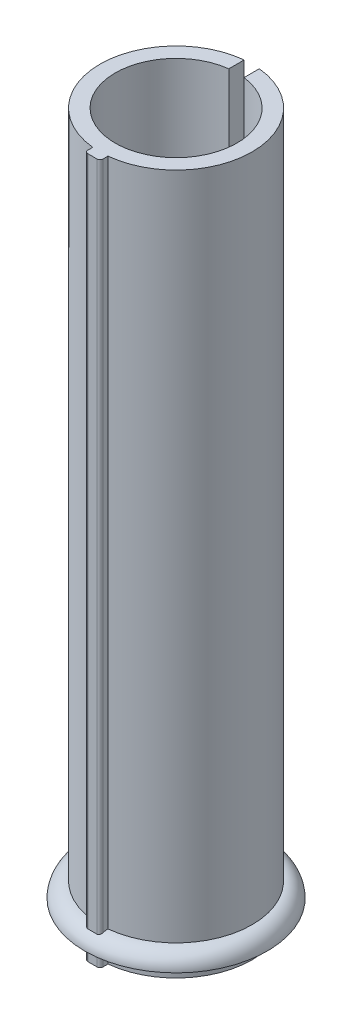
ISO-10303-21;
HEADER;
FILE_DESCRIPTION(('STEP AP214'),'2;1');
FILE_NAME('part.step','',(''),(''),'','','');
FILE_SCHEMA(('AUTOMOTIVE_DESIGN { 1 0 10303 214 1 1 1 1 }'));
ENDSEC;
DATA;
#1=APPLICATION_CONTEXT('core data for automotive mechanical design processes');
#2=APPLICATION_PROTOCOL_DEFINITION('international standard','automotive_design',2000,#1);
#3=PRODUCT_CONTEXT('',#1,'mechanical');
#4=PRODUCT('Part','Part','',(#3));
#5=PRODUCT_RELATED_PRODUCT_CATEGORY('part','',(#4));
#6=PRODUCT_DEFINITION_FORMATION('','',#4);
#7=PRODUCT_DEFINITION_CONTEXT('part definition',#1,'design');
#8=PRODUCT_DEFINITION('design','',#6,#7);
#9=PRODUCT_DEFINITION_SHAPE('','',#8);
#10=(LENGTH_UNIT() NAMED_UNIT(*) SI_UNIT(.MILLI.,.METRE.));
#11=(NAMED_UNIT(*) PLANE_ANGLE_UNIT() SI_UNIT($,.RADIAN.));
#12=(NAMED_UNIT(*) SI_UNIT($,.STERADIAN.) SOLID_ANGLE_UNIT());
#13=UNCERTAINTY_MEASURE_WITH_UNIT(LENGTH_MEASURE(1.E-05),#10,'distance_accuracy_value','');
#14=(GEOMETRIC_REPRESENTATION_CONTEXT(3) GLOBAL_UNCERTAINTY_ASSIGNED_CONTEXT((#13)) GLOBAL_UNIT_ASSIGNED_CONTEXT((#10,
#11,#12)) REPRESENTATION_CONTEXT('',''));
#15=CARTESIAN_POINT('',(0.,0.,0.));
#16=DIRECTION('',(0.,0.,1.));
#17=DIRECTION('',(1.,0.,0.));
#18=AXIS2_PLACEMENT_3D('',#15,#16,#17);
#19=CARTESIAN_POINT('',(0.,-5.,0.));
#20=DIRECTION('',(0.,1.,0.));
#21=DIRECTION('',(0.,0.,1.));
#22=AXIS2_PLACEMENT_3D('',#19,#20,#21);
#23=CYLINDRICAL_SURFACE('',#22,25.);
#24=DIRECTION('',(0.,1.,0.));
#25=VECTOR('',#24,1.);
#26=CARTESIAN_POINT('',(2.5,-5.,-24.8746859276655));
#27=LINE('',#26,#25);
#28=CARTESIAN_POINT('',(2.5,-5.,-24.8746859276655));
#29=VERTEX_POINT('',#28);
#30=CARTESIAN_POINT('',(2.5,0.,-24.8746859276655));
#31=VERTEX_POINT('',#30);
#32=EDGE_CURVE('E194',#29,#31,#27,.T.);
#33=ORIENTED_EDGE('',*,*,#32,.T.);
#34=CARTESIAN_POINT('',(0.,0.,0.));
#35=DIRECTION('',(0.,1.,0.));
#36=DIRECTION('',(0.,0.,1.));
#37=AXIS2_PLACEMENT_3D('',#34,#35,#36);
#38=CIRCLE('',#37,25.);
#39=CARTESIAN_POINT('',(2.5,0.,24.8746859276655));
#40=VERTEX_POINT('',#39);
#41=EDGE_CURVE('E217',#31,#40,#38,.F.);
#42=ORIENTED_EDGE('',*,*,#41,.T.);
#43=DIRECTION('',(0.,1.,0.));
#44=VECTOR('',#43,1.);
#45=CARTESIAN_POINT('',(2.5,-5.,24.8746859276655));
#46=LINE('',#45,#44);
#47=CARTESIAN_POINT('',(2.5,-5.,24.8746859276655));
#48=VERTEX_POINT('',#47);
#49=EDGE_CURVE('E332',#48,#40,#46,.T.);
#50=ORIENTED_EDGE('',*,*,#49,.F.);
#51=CARTESIAN_POINT('',(0.,-5.,0.));
#52=DIRECTION('',(0.,1.,0.));
#53=DIRECTION('',(0.,0.,1.));
#54=AXIS2_PLACEMENT_3D('',#51,#52,#53);
#55=CIRCLE('',#54,25.);
#56=EDGE_CURVE('E292',#48,#29,#55,.T.);
#57=ORIENTED_EDGE('',*,*,#56,.T.);
#58=EDGE_LOOP('',(#33,#42,#50,#57));
#59=FACE_BOUND('',#58,.T.);
#60=ADVANCED_FACE('F39',(#59),#23,.T.);
#61=CARTESIAN_POINT('',(2.5,-5.,24.8746859276655));
#62=DIRECTION('',(1.,0.,0.));
#63=DIRECTION('',(0.,0.,-1.));
#64=AXIS2_PLACEMENT_3D('',#61,#62,#63);
#65=PLANE('',#64);
#66=ORIENTED_EDGE('',*,*,#49,.T.);
#67=DIRECTION('',(0.,0.,1.));
#68=VECTOR('',#67,1.);
#69=CARTESIAN_POINT('',(2.5,0.,24.8746859276655));
#70=LINE('',#69,#68);
#71=CARTESIAN_POINT('',(2.5,0.,26.5));
#72=VERTEX_POINT('',#71);
#73=EDGE_CURVE('E224',#40,#72,#70,.T.);
#74=ORIENTED_EDGE('',*,*,#73,.T.);
#75=DIRECTION('',(0.,1.,0.));
#76=VECTOR('',#75,1.);
#77=CARTESIAN_POINT('',(2.5,-5.,26.5));
#78=LINE('',#77,#76);
#79=CARTESIAN_POINT('',(2.5,-5.,26.5));
#80=VERTEX_POINT('',#79);
#81=EDGE_CURVE('E337',#80,#72,#78,.T.);
#82=ORIENTED_EDGE('',*,*,#81,.F.);
#83=DIRECTION('',(0.,0.,-1.));
#84=VECTOR('',#83,1.);
#85=CARTESIAN_POINT('',(2.5,-5.,24.8746859276655));
#86=LINE('',#85,#84);
#87=EDGE_CURVE('E328',#80,#48,#86,.T.);
#88=ORIENTED_EDGE('',*,*,#87,.T.);
#89=EDGE_LOOP('',(#66,#74,#82,#88));
#90=FACE_BOUND('',#89,.T.);
#91=ADVANCED_FACE('F428',(#90),#65,.T.);
#92=CARTESIAN_POINT('',(1.5,-5.,26.5));
#93=DIRECTION('',(0.,1.,0.));
#94=DIRECTION('',(0.,0.,1.));
#95=AXIS2_PLACEMENT_3D('',#92,#93,#94);
#96=CYLINDRICAL_SURFACE('',#95,1.);
#97=ORIENTED_EDGE('',*,*,#81,.T.);
#98=CARTESIAN_POINT('',(1.5,0.,26.5));
#99=DIRECTION('',(0.,1.,0.));
#100=DIRECTION('',(0.,0.,1.));
#101=AXIS2_PLACEMENT_3D('',#98,#99,#100);
#102=CIRCLE('',#101,1.);
#103=CARTESIAN_POINT('',(1.5,0.,27.5));
#104=VERTEX_POINT('',#103);
#105=EDGE_CURVE('E227',#72,#104,#102,.F.);
#106=ORIENTED_EDGE('',*,*,#105,.T.);
#107=DIRECTION('',(0.,1.,0.));
#108=VECTOR('',#107,1.);
#109=CARTESIAN_POINT('',(1.5,-5.,27.5));
#110=LINE('',#109,#108);
#111=CARTESIAN_POINT('',(1.5,-5.,27.5));
#112=VERTEX_POINT('',#111);
#113=EDGE_CURVE('E341',#112,#104,#110,.T.);
#114=ORIENTED_EDGE('',*,*,#113,.F.);
#115=CARTESIAN_POINT('',(1.5,-5.,26.5));
#116=DIRECTION('',(0.,1.,0.));
#117=DIRECTION('',(0.,0.,1.));
#118=AXIS2_PLACEMENT_3D('',#115,#116,#117);
#119=CIRCLE('',#118,1.);
#120=EDGE_CURVE('E324',#112,#80,#119,.T.);
#121=ORIENTED_EDGE('',*,*,#120,.T.);
#122=EDGE_LOOP('',(#97,#106,#114,#121));
#123=FACE_BOUND('',#122,.T.);
#124=ADVANCED_FACE('F436',(#123),#96,.T.);
#125=CARTESIAN_POINT('',(-1.49999999999999,-5.,27.5));
#126=DIRECTION('',(0.,0.,1.));
#127=DIRECTION('',(1.,0.,0.));
#128=AXIS2_PLACEMENT_3D('',#125,#126,#127);
#129=PLANE('',#128);
#130=ORIENTED_EDGE('',*,*,#113,.T.);
#131=DIRECTION('',(-1.,0.,0.));
#132=VECTOR('',#131,1.);
#133=CARTESIAN_POINT('',(-1.49999999999999,0.,27.5));
#134=LINE('',#133,#132);
#135=CARTESIAN_POINT('',(-1.5,0.,27.5));
#136=VERTEX_POINT('',#135);
#137=EDGE_CURVE('E230',#104,#136,#134,.T.);
#138=ORIENTED_EDGE('',*,*,#137,.T.);
#139=DIRECTION('',(0.,1.,0.));
#140=VECTOR('',#139,1.);
#141=CARTESIAN_POINT('',(-1.5,-5.,27.5));
#142=LINE('',#141,#140);
#143=CARTESIAN_POINT('',(-1.5,-5.,27.5));
#144=VERTEX_POINT('',#143);
#145=EDGE_CURVE('E345',#144,#136,#142,.T.);
#146=ORIENTED_EDGE('',*,*,#145,.F.);
#147=DIRECTION('',(1.,0.,0.));
#148=VECTOR('',#147,1.);
#149=CARTESIAN_POINT('',(-1.49999999999999,-5.,27.5));
#150=LINE('',#149,#148);
#151=EDGE_CURVE('E320',#144,#112,#150,.T.);
#152=ORIENTED_EDGE('',*,*,#151,.T.);
#153=EDGE_LOOP('',(#130,#138,#146,#152));
#154=FACE_BOUND('',#153,.T.);
#155=ADVANCED_FACE('F469',(#154),#129,.T.);
#156=CARTESIAN_POINT('',(-1.5,-5.,26.5));
#157=DIRECTION('',(0.,1.,0.));
#158=DIRECTION('',(0.,0.,1.));
#159=AXIS2_PLACEMENT_3D('',#156,#157,#158);
#160=CYLINDRICAL_SURFACE('',#159,1.);
#161=ORIENTED_EDGE('',*,*,#145,.T.);
#162=CARTESIAN_POINT('',(-1.5,0.,26.5));
#163=DIRECTION('',(0.,1.,0.));
#164=DIRECTION('',(0.,0.,1.));
#165=AXIS2_PLACEMENT_3D('',#162,#163,#164);
#166=CIRCLE('',#165,1.);
#167=CARTESIAN_POINT('',(-2.5,0.,26.5));
#168=VERTEX_POINT('',#167);
#169=EDGE_CURVE('E233',#136,#168,#166,.F.);
#170=ORIENTED_EDGE('',*,*,#169,.T.);
#171=DIRECTION('',(0.,1.,0.));
#172=VECTOR('',#171,1.);
#173=CARTESIAN_POINT('',(-2.5,-5.,26.5));
#174=LINE('',#173,#172);
#175=CARTESIAN_POINT('',(-2.5,-5.,26.5));
#176=VERTEX_POINT('',#175);
#177=EDGE_CURVE('E350',#176,#168,#174,.T.);
#178=ORIENTED_EDGE('',*,*,#177,.F.);
#179=CARTESIAN_POINT('',(-1.5,-5.,26.5));
#180=DIRECTION('',(0.,1.,0.));
#181=DIRECTION('',(0.,0.,1.));
#182=AXIS2_PLACEMENT_3D('',#179,#180,#181);
#183=CIRCLE('',#182,1.);
#184=EDGE_CURVE('E316',#176,#144,#183,.T.);
#185=ORIENTED_EDGE('',*,*,#184,.T.);
#186=EDGE_LOOP('',(#161,#170,#178,#185));
#187=FACE_BOUND('',#186,.T.);
#188=ADVANCED_FACE('F467',(#187),#160,.T.);
#189=CARTESIAN_POINT('',(-2.5,-5.,24.8746859276655));
#190=DIRECTION('',(-1.,0.,0.));
#191=DIRECTION('',(0.,0.,1.));
#192=AXIS2_PLACEMENT_3D('',#189,#190,#191);
#193=PLANE('',#192);
#194=ORIENTED_EDGE('',*,*,#177,.T.);
#195=DIRECTION('',(0.,0.,-1.));
#196=VECTOR('',#195,1.);
#197=CARTESIAN_POINT('',(-2.5,0.,24.8746859276655));
#198=LINE('',#197,#196);
#199=CARTESIAN_POINT('',(-2.5,0.,24.8746859276655));
#200=VERTEX_POINT('',#199);
#201=EDGE_CURVE('E236',#168,#200,#198,.T.);
#202=ORIENTED_EDGE('',*,*,#201,.T.);
#203=DIRECTION('',(0.,1.,0.));
#204=VECTOR('',#203,1.);
#205=CARTESIAN_POINT('',(-2.5,-5.,24.8746859276655));
#206=LINE('',#205,#204);
#207=CARTESIAN_POINT('',(-2.5,-5.,24.8746859276655));
#208=VERTEX_POINT('',#207);
#209=EDGE_CURVE('E355',#208,#200,#206,.T.);
#210=ORIENTED_EDGE('',*,*,#209,.F.);
#211=DIRECTION('',(0.,0.,1.));
#212=VECTOR('',#211,1.);
#213=CARTESIAN_POINT('',(-2.5,-5.,24.8746859276655));
#214=LINE('',#213,#212);
#215=EDGE_CURVE('E312',#208,#176,#214,.T.);
#216=ORIENTED_EDGE('',*,*,#215,.T.);
#217=EDGE_LOOP('',(#194,#202,#210,#216));
#218=FACE_BOUND('',#217,.T.);
#219=ADVANCED_FACE('F401',(#218),#193,.T.);
#220=CARTESIAN_POINT('',(0.,-5.,0.));
#221=DIRECTION('',(0.,1.,0.));
#222=DIRECTION('',(0.,0.,1.));
#223=AXIS2_PLACEMENT_3D('',#220,#221,#222);
#224=CYLINDRICAL_SURFACE('',#223,25.);
#225=ORIENTED_EDGE('',*,*,#209,.T.);
#226=CARTESIAN_POINT('',(0.,0.,0.));
#227=DIRECTION('',(0.,1.,0.));
#228=DIRECTION('',(0.,0.,1.));
#229=AXIS2_PLACEMENT_3D('',#226,#227,#228);
#230=CIRCLE('',#229,25.);
#231=CARTESIAN_POINT('',(-2.5,0.,-24.8746859276655));
#232=VERTEX_POINT('',#231);
#233=EDGE_CURVE('E239',#200,#232,#230,.F.);
#234=ORIENTED_EDGE('',*,*,#233,.T.);
#235=DIRECTION('',(0.,1.,0.));
#236=VECTOR('',#235,1.);
#237=CARTESIAN_POINT('',(-2.5,-5.,-24.8746859276655));
#238=LINE('',#237,#236);
#239=CARTESIAN_POINT('',(-2.5,-5.,-24.8746859276655));
#240=VERTEX_POINT('',#239);
#241=EDGE_CURVE('E360',#240,#232,#238,.T.);
#242=ORIENTED_EDGE('',*,*,#241,.F.);
#243=CARTESIAN_POINT('',(0.,-5.,0.));
#244=DIRECTION('',(0.,1.,0.));
#245=DIRECTION('',(0.,0.,1.));
#246=AXIS2_PLACEMENT_3D('',#243,#244,#245);
#247=CIRCLE('',#246,25.);
#248=EDGE_CURVE('E308',#240,#208,#247,.T.);
#249=ORIENTED_EDGE('',*,*,#248,.T.);
#250=EDGE_LOOP('',(#225,#234,#242,#249));
#251=FACE_BOUND('',#250,.T.);
#252=ADVANCED_FACE('F408',(#251),#224,.T.);
#253=CARTESIAN_POINT('',(-2.5,-5.,-19.8431348329844));
#254=DIRECTION('',(1.,0.,0.));
#255=DIRECTION('',(0.,0.,-1.));
#256=AXIS2_PLACEMENT_3D('',#253,#254,#255);
#257=PLANE('',#256);
#258=ORIENTED_EDGE('',*,*,#241,.T.);
#259=DIRECTION('',(0.,0.,1.));
#260=VECTOR('',#259,1.);
#261=CARTESIAN_POINT('',(-2.5,0.,-19.8431348329844));
#262=LINE('',#261,#260);
#263=CARTESIAN_POINT('',(-2.5,0.,-19.8431348329844));
#264=VERTEX_POINT('',#263);
#265=EDGE_CURVE('E242',#232,#264,#262,.T.);
#266=ORIENTED_EDGE('',*,*,#265,.T.);
#267=DIRECTION('',(0.,1.,0.));
#268=VECTOR('',#267,1.);
#269=CARTESIAN_POINT('',(-2.5,-5.,-19.8431348329844));
#270=LINE('',#269,#268);
#271=CARTESIAN_POINT('',(-2.5,-5.,-19.8431348329844));
#272=VERTEX_POINT('',#271);
#273=EDGE_CURVE('E365',#272,#264,#270,.T.);
#274=ORIENTED_EDGE('',*,*,#273,.F.);
#275=DIRECTION('',(0.,0.,-1.));
#276=VECTOR('',#275,1.);
#277=CARTESIAN_POINT('',(-2.5,-5.,-19.8431348329844));
#278=LINE('',#277,#276);
#279=EDGE_CURVE('E304',#272,#240,#278,.T.);
#280=ORIENTED_EDGE('',*,*,#279,.T.);
#281=EDGE_LOOP('',(#258,#266,#274,#280));
#282=FACE_BOUND('',#281,.T.);
#283=ADVANCED_FACE('F412',(#282),#257,.T.);
#284=CARTESIAN_POINT('',(2.5,-5.,-19.8431348329844));
#285=DIRECTION('',(-1.,0.,0.));
#286=DIRECTION('',(0.,0.,1.));
#287=AXIS2_PLACEMENT_3D('',#284,#285,#286);
#288=PLANE('',#287);
#289=DIRECTION('',(0.,1.,0.));
#290=VECTOR('',#289,1.);
#291=CARTESIAN_POINT('',(2.5,-5.,-19.8431348329844));
#292=LINE('',#291,#290);
#293=CARTESIAN_POINT('',(2.5,-5.,-19.8431348329844));
#294=VERTEX_POINT('',#293);
#295=CARTESIAN_POINT('',(2.5,0.,-19.8431348329844));
#296=VERTEX_POINT('',#295);
#297=EDGE_CURVE('E193',#294,#296,#292,.T.);
#298=ORIENTED_EDGE('',*,*,#297,.T.);
#299=DIRECTION('',(0.,0.,-1.));
#300=VECTOR('',#299,1.);
#301=CARTESIAN_POINT('',(2.5,0.,-19.8431348329844));
#302=LINE('',#301,#300);
#303=EDGE_CURVE('E204',#296,#31,#302,.T.);
#304=ORIENTED_EDGE('',*,*,#303,.T.);
#305=ORIENTED_EDGE('',*,*,#32,.F.);
#306=DIRECTION('',(0.,0.,1.));
#307=VECTOR('',#306,1.);
#308=CARTESIAN_POINT('',(2.5,-5.,-19.8431348329844));
#309=LINE('',#308,#307);
#310=EDGE_CURVE('E296',#29,#294,#309,.T.);
#311=ORIENTED_EDGE('',*,*,#310,.T.);
#312=EDGE_LOOP('',(#298,#304,#305,#311));
#313=FACE_BOUND('',#312,.T.);
#314=ADVANCED_FACE('F418',(#313),#288,.T.);
#315=CARTESIAN_POINT('',(0.,5.,0.));
#316=DIRECTION('',(0.,1.,0.));
#317=DIRECTION('',(0.,0.,1.));
#318=AXIS2_PLACEMENT_3D('',#315,#316,#317);
#319=CIRCLE('',#318,25.);
#320=CARTESIAN_POINT('',(2.5,5.,-24.8746859276655));
#321=VERTEX_POINT('',#320);
#322=CARTESIAN_POINT('',(2.5,5.,24.8746859276655));
#323=VERTEX_POINT('',#322);
#324=EDGE_CURVE('E245',#321,#323,#319,.F.);
#325=ORIENTED_EDGE('',*,*,#324,.F.);
#326=CARTESIAN_POINT('',(2.5,225.,-24.8746859276655));
#327=VERTEX_POINT('',#326);
#328=EDGE_CURVE('E200',#321,#327,#27,.T.);
#329=ORIENTED_EDGE('',*,*,#328,.T.);
#330=CARTESIAN_POINT('',(0.,225.,0.));
#331=DIRECTION('',(0.,1.,0.));
#332=DIRECTION('',(0.,0.,1.));
#333=AXIS2_PLACEMENT_3D('',#330,#331,#332);
#334=CIRCLE('',#333,25.);
#335=CARTESIAN_POINT('',(2.5,225.,24.8746859276655));
#336=VERTEX_POINT('',#335);
#337=EDGE_CURVE('E255',#336,#327,#334,.T.);
#338=ORIENTED_EDGE('',*,*,#337,.F.);
#339=EDGE_CURVE('E336',#323,#336,#46,.T.);
#340=ORIENTED_EDGE('',*,*,#339,.F.);
#341=EDGE_LOOP('',(#325,#329,#338,#340));
#342=FACE_BOUND('',#341,.T.);
#343=ADVANCED_FACE('F419',(#342),#23,.T.);
#344=CARTESIAN_POINT('',(2.5,4.73108501515423,26.5));
#345=VERTEX_POINT('',#344);
#346=CARTESIAN_POINT('',(2.5,225.,26.5));
#347=VERTEX_POINT('',#346);
#348=EDGE_CURVE('E60',#345,#347,#78,.T.);
#349=ORIENTED_EDGE('',*,*,#348,.F.);
#350=CARTESIAN_POINT('',(2.5,4.73108501515423,26.5));
#351=CARTESIAN_POINT('',(2.5,4.77568571154399,26.3690188122208));
#352=CARTESIAN_POINT('',(2.5,4.81486236841745,26.2361943761114));
#353=CARTESIAN_POINT('',(2.5,4.88194298696545,25.9686718117443));
#354=CARTESIAN_POINT('',(2.5,4.90992049404703,25.8339921239666));
#355=CARTESIAN_POINT('',(2.5,4.95477867167907,25.5627985303928));
#356=CARTESIAN_POINT('',(2.5,4.97165941315023,25.4262846363251));
#357=CARTESIAN_POINT('',(2.5,4.99431401461683,25.151413770997));
#358=CARTESIAN_POINT('',(2.5,5.00001242725479,25.0130505789747));
#359=CARTESIAN_POINT('',(2.5,5.,24.8746859276655));
#360=B_SPLINE_CURVE_WITH_KNOTS('',3,(#350,#351,#352,#353,#354,#355,#356,#357,#358,#359),
.UNSPECIFIED.,.F.,.F.,(4,2,2,2,4),(0.,0.414976925700271,0.827182115937586,1.23938467169812,
1.6543589309556),.UNSPECIFIED.);
#361=EDGE_CURVE('E11',#345,#323,#360,.T.);
#362=ORIENTED_EDGE('',*,*,#361,.T.);
#363=ORIENTED_EDGE('',*,*,#339,.T.);
#364=DIRECTION('',(0.,0.,-1.));
#365=VECTOR('',#364,1.);
#366=CARTESIAN_POINT('',(2.5,225.,24.8746859276655));
#367=LINE('',#366,#365);
#368=EDGE_CURVE('E288',#347,#336,#367,.T.);
#369=ORIENTED_EDGE('',*,*,#368,.F.);
#370=EDGE_LOOP('',(#349,#362,#363,#369));
#371=FACE_BOUND('',#370,.T.);
#372=ADVANCED_FACE('F421',(#371),#65,.T.);
#373=CARTESIAN_POINT('',(1.5,4.3062669903341,27.5));
#374=VERTEX_POINT('',#373);
#375=CARTESIAN_POINT('',(1.5,225.,27.5));
#376=VERTEX_POINT('',#375);
#377=EDGE_CURVE('E67',#374,#376,#110,.T.);
#378=ORIENTED_EDGE('',*,*,#377,.F.);
#379=CARTESIAN_POINT('',(1.5,4.3062669903341,27.5));
#380=CARTESIAN_POINT('',(1.52542514005268,4.30544779825903,27.5000015178773));
#381=CARTESIAN_POINT('',(1.55085554431769,4.30518292201786,27.4990295796368));
#382=CARTESIAN_POINT('',(1.60154856244067,4.30575435231049,27.4951552132795));
#383=CARTESIAN_POINT('',(1.6268112258746,4.30659031746843,27.4922533837687));
#384=CARTESIAN_POINT('',(1.70183532556383,4.31072326394032,27.4807180782456));
#385=CARTESIAN_POINT('',(1.75110861252743,4.31563675258997,27.4692543468811));
#386=CARTESIAN_POINT('',(1.84679286094547,4.32938677301816,27.4392827422562));
#387=CARTESIAN_POINT('',(1.89320596871457,4.33822032128135,27.420780227664));
#388=CARTESIAN_POINT('',(1.98220852104497,4.35917988941921,27.3774548719788));
#389=CARTESIAN_POINT('',(2.02479449200809,4.3713088609241,27.3526263660965));
#390=CARTESIAN_POINT('',(2.10744121902948,4.39882665013424,27.2960242803881));
#391=CARTESIAN_POINT('',(2.14725238886705,4.41435307556053,27.2639547442836));
#392=CARTESIAN_POINT('',(2.22113412084935,4.4473873829196,27.1946467648329));
#393=CARTESIAN_POINT('',(2.25520211759608,4.46489614452878,27.1574060250536));
#394=CARTESIAN_POINT('',(2.3208801384558,4.50329132402285,27.0738538727171));
#395=CARTESIAN_POINT('',(2.35169957241962,4.52433053930137,27.0269901913995));
#396=CARTESIAN_POINT('',(2.40503927200349,4.56691889028568,26.9289745748721));
#397=CARTESIAN_POINT('',(2.42755841526003,4.58846809453313,26.8778220608744));
#398=CARTESIAN_POINT('',(2.46352159744723,4.63086014156109,26.7731904730696));
#399=CARTESIAN_POINT('',(2.47710564381874,4.65170877057509,26.7197619902835));
#400=CARTESIAN_POINT('',(2.49535299467913,4.6923593383146,26.6110051857504));
#401=CARTESIAN_POINT('',(2.50001366777915,4.71216096661961,26.5556763084962));
#402=CARTESIAN_POINT('',(2.5,4.73108501515419,26.5));
#403=B_SPLINE_CURVE_WITH_KNOTS('',3,(#379,#380,#381,#382,#383,#384,#385,#386,#387,#388,#389,
#390,#391,#392,#393,#394,#395,#396,#397,#398,#399,#400,#401,#402),.UNSPECIFIED.,.F.,.F.,(4,2,2,
2,2,2,2,2,2,2,2,4),(0.,0.0762656217552419,0.152507598766534,0.304175316353956,0.455727798713986,
0.607416472987797,0.76706088385312,0.926776417849669,1.10573361050072,1.28471499283489,
1.46082044507498,1.63697782057126),.UNSPECIFIED.);
#404=EDGE_CURVE('E54',#374,#345,#403,.T.);
#405=ORIENTED_EDGE('',*,*,#404,.T.);
#406=ORIENTED_EDGE('',*,*,#348,.T.);
#407=CARTESIAN_POINT('',(1.5,225.,26.5));
#408=DIRECTION('',(0.,1.,0.));
#409=DIRECTION('',(0.,0.,1.));
#410=AXIS2_PLACEMENT_3D('',#407,#408,#409);
#411=CIRCLE('',#410,1.);
#412=EDGE_CURVE('E284',#376,#347,#411,.T.);
#413=ORIENTED_EDGE('',*,*,#412,.F.);
#414=EDGE_LOOP('',(#378,#405,#406,#413));
#415=FACE_BOUND('',#414,.T.);
#416=ADVANCED_FACE('F427',(#415),#96,.T.);
#417=CARTESIAN_POINT('',(-1.5,4.3062669903341,27.5));
#418=VERTEX_POINT('',#417);
#419=CARTESIAN_POINT('',(-1.5,225.,27.5));
#420=VERTEX_POINT('',#419);
#421=EDGE_CURVE('E349',#418,#420,#142,.T.);
#422=ORIENTED_EDGE('',*,*,#421,.F.);
#423=CARTESIAN_POINT('',(-1.5,4.3062669903341,27.5));
#424=CARTESIAN_POINT('',(-1.25005334932238,4.31427968215083,27.5));
#425=CARTESIAN_POINT('',(-1.00004296433229,4.32024518484277,27.5));
#426=CARTESIAN_POINT('',(-0.500021708817723,4.32816834659106,27.5));
#427=CARTESIAN_POINT('',(-0.250010854408862,4.33012701893014,27.5));
#428=CARTESIAN_POINT('',(0.250010854408862,4.33012701893014,27.5));
#429=CARTESIAN_POINT('',(0.500021708817723,4.32816834659106,27.5));
#430=CARTESIAN_POINT('',(1.00004296433229,4.32024518484277,27.5));
#431=CARTESIAN_POINT('',(1.25005334932238,4.31427968215083,27.5));
#432=CARTESIAN_POINT('',(1.5,4.3062669903341,27.5));
#433=B_SPLINE_CURVE_WITH_KNOTS('',3,(#423,#424,#425,#426,#427,#428,#429,#430,#431,#432),
.UNSPECIFIED.,.F.,.F.,(4,2,2,2,4),(0.,0.750213822316163,1.50023790045688,2.2502619785976,
3.00047580091376),.UNSPECIFIED.);
#434=EDGE_CURVE('E488',#418,#374,#433,.T.);
#435=ORIENTED_EDGE('',*,*,#434,.T.);
#436=ORIENTED_EDGE('',*,*,#377,.T.);
#437=DIRECTION('',(1.,0.,0.));
#438=VECTOR('',#437,1.);
#439=CARTESIAN_POINT('',(-1.49999999999999,225.,27.5));
#440=LINE('',#439,#438);
#441=EDGE_CURVE('E280',#420,#376,#440,.T.);
#442=ORIENTED_EDGE('',*,*,#441,.F.);
#443=EDGE_LOOP('',(#422,#435,#436,#442));
#444=FACE_BOUND('',#443,.T.);
#445=ADVANCED_FACE('F471',(#444),#129,.T.);
#446=CARTESIAN_POINT('',(-2.5,4.73108501515423,26.5));
#447=VERTEX_POINT('',#446);
#448=CARTESIAN_POINT('',(-2.5,225.,26.5));
#449=VERTEX_POINT('',#448);
#450=EDGE_CURVE('E354',#447,#449,#174,.T.);
#451=ORIENTED_EDGE('',*,*,#450,.F.);
#452=CARTESIAN_POINT('',(-2.5,4.73108501515423,26.5));
#453=CARTESIAN_POINT('',(-2.50001739949812,4.71058879509126,26.5603247984808));
#454=CARTESIAN_POINT('',(-2.49454520881726,4.68905522001453,26.6202323170742));
#455=CARTESIAN_POINT('',(-2.47317024852415,4.64483666543262,26.7376725550921));
#456=CARTESIAN_POINT('',(-2.45727531604888,4.62215256285491,26.7952070243529));
#457=CARTESIAN_POINT('',(-2.41561260669543,4.57653450298506,26.9064273708881));
#458=CARTESIAN_POINT('',(-2.38984992094265,4.55360068045066,26.9601152158455));
#459=CARTESIAN_POINT('',(-2.32902704968068,4.50854354779879,27.0623631269312));
#460=CARTESIAN_POINT('',(-2.29396342382236,4.48642054104957,27.1109212863146));
#461=CARTESIAN_POINT('',(-2.21494359753246,4.44409436109972,27.2017857409825));
#462=CARTESIAN_POINT('',(-2.17093441367647,4.42390373331824,27.2440520579236));
#463=CARTESIAN_POINT('',(-2.07502725283776,4.38702883452189,27.3204221458031));
#464=CARTESIAN_POINT('',(-2.0231334538411,4.37034271758875,27.3545302152269));
#465=CARTESIAN_POINT('',(-1.91751674326718,4.34317605948388,27.4104640061131));
#466=CARTESIAN_POINT('',(-1.86432096045477,4.332289641705,27.4330852942744));
#467=CARTESIAN_POINT('',(-1.75412519397334,4.31575318122285,27.4688937902549));
#468=CARTESIAN_POINT('',(-1.69713459261454,4.31009070312766,27.4821033850822));
#469=CARTESIAN_POINT('',(-1.61629973941916,4.30622549286048,27.4934901634356));
#470=CARTESIAN_POINT('',(-1.59309568655235,4.30558519106267,27.4959310735868));
#471=CARTESIAN_POINT('',(-1.54659407288781,4.30523206035956,27.4991846563097));
#472=CARTESIAN_POINT('',(-1.52329665416467,4.30551814151529,27.4999992405168));
#473=CARTESIAN_POINT('',(-1.5,4.3062669903341,27.5));
#474=B_SPLINE_CURVE_WITH_KNOTS('',3,(#452,#453,#454,#455,#456,#457,#458,#459,#460,#461,#462,
#463,#464,#465,#466,#467,#468,#469,#470,#471,#472,#473),.UNSPECIFIED.,.F.,.F.,(4,2,2,2,2,2,2,2,
2,2,4),(0.,0.19080738669647,0.381471464508688,0.572037304149357,0.762673731220781,
0.954474018767247,1.1461730252662,1.3216367118425,1.49668162775865,1.56664303992081,
1.63652216867035),.UNSPECIFIED.);
#475=EDGE_CURVE('E387',#447,#418,#474,.T.);
#476=ORIENTED_EDGE('',*,*,#475,.T.);
#477=ORIENTED_EDGE('',*,*,#421,.T.);
#478=CARTESIAN_POINT('',(-1.5,225.,26.5));
#479=DIRECTION('',(0.,1.,0.));
#480=DIRECTION('',(0.,0.,1.));
#481=AXIS2_PLACEMENT_3D('',#478,#479,#480);
#482=CIRCLE('',#481,1.);
#483=EDGE_CURVE('E276',#449,#420,#482,.T.);
#484=ORIENTED_EDGE('',*,*,#483,.F.);
#485=EDGE_LOOP('',(#451,#476,#477,#484));
#486=FACE_BOUND('',#485,.T.);
#487=ADVANCED_FACE('F399',(#486),#160,.T.);
#488=CARTESIAN_POINT('',(-2.5,5.,24.8746859276655));
#489=VERTEX_POINT('',#488);
#490=CARTESIAN_POINT('',(-2.5,225.,24.8746859276655));
#491=VERTEX_POINT('',#490);
#492=EDGE_CURVE('E359',#489,#491,#206,.T.);
#493=ORIENTED_EDGE('',*,*,#492,.F.);
#494=CARTESIAN_POINT('',(-2.5,5.,24.8746859276655));
#495=CARTESIAN_POINT('',(-2.5,5.00001242725479,25.0130505789747));
#496=CARTESIAN_POINT('',(-2.5,4.99431401461683,25.151413770997));
#497=CARTESIAN_POINT('',(-2.5,4.97165941315023,25.4262846363252));
#498=CARTESIAN_POINT('',(-2.5,4.95477867167907,25.5627985303928));
#499=CARTESIAN_POINT('',(-2.5,4.90992049404703,25.8339921239666));
#500=CARTESIAN_POINT('',(-2.5,4.88194298696546,25.9686718117443));
#501=CARTESIAN_POINT('',(-2.5,4.81486236841744,26.2361943761114));
#502=CARTESIAN_POINT('',(-2.5,4.77568571154397,26.3690188122209));
#503=CARTESIAN_POINT('',(-2.5,4.73108501515419,26.5));
#504=B_SPLINE_CURVE_WITH_KNOTS('',3,(#494,#495,#496,#497,#498,#499,#500,#501,#502,#503),
.UNSPECIFIED.,.F.,.F.,(4,2,2,2,4),(0.,0.414974259257486,0.82717681501802,1.23938200525534,
1.65435893095562),.UNSPECIFIED.);
#505=EDGE_CURVE('E378',#489,#447,#504,.T.);
#506=ORIENTED_EDGE('',*,*,#505,.T.);
#507=ORIENTED_EDGE('',*,*,#450,.T.);
#508=DIRECTION('',(0.,0.,1.));
#509=VECTOR('',#508,1.);
#510=CARTESIAN_POINT('',(-2.5,225.,24.8746859276655));
#511=LINE('',#510,#509);
#512=EDGE_CURVE('E272',#491,#449,#511,.T.);
#513=ORIENTED_EDGE('',*,*,#512,.F.);
#514=EDGE_LOOP('',(#493,#506,#507,#513));
#515=FACE_BOUND('',#514,.T.);
#516=ADVANCED_FACE('F394',(#515),#193,.T.);
#517=CARTESIAN_POINT('',(0.,5.,0.));
#518=DIRECTION('',(0.,1.,0.));
#519=DIRECTION('',(0.,0.,1.));
#520=AXIS2_PLACEMENT_3D('',#517,#518,#519);
#521=CIRCLE('',#520,25.);
#522=CARTESIAN_POINT('',(-2.5,5.,-24.8746859276655));
#523=VERTEX_POINT('',#522);
#524=EDGE_CURVE('E249',#489,#523,#521,.F.);
#525=ORIENTED_EDGE('',*,*,#524,.F.);
#526=ORIENTED_EDGE('',*,*,#492,.T.);
#527=CARTESIAN_POINT('',(0.,225.,0.));
#528=DIRECTION('',(0.,1.,0.));
#529=DIRECTION('',(0.,0.,1.));
#530=AXIS2_PLACEMENT_3D('',#527,#528,#529);
#531=CIRCLE('',#530,25.);
#532=CARTESIAN_POINT('',(-2.5,225.,-24.8746859276655));
#533=VERTEX_POINT('',#532);
#534=EDGE_CURVE('E268',#533,#491,#531,.T.);
#535=ORIENTED_EDGE('',*,*,#534,.F.);
#536=EDGE_CURVE('E364',#523,#533,#238,.T.);
#537=ORIENTED_EDGE('',*,*,#536,.F.);
#538=EDGE_LOOP('',(#525,#526,#535,#537));
#539=FACE_BOUND('',#538,.T.);
#540=ADVANCED_FACE('F398',(#539),#224,.T.);
#541=DIRECTION('',(0.,0.,1.));
#542=VECTOR('',#541,1.);
#543=CARTESIAN_POINT('',(-2.5,5.,-19.8431348329844));
#544=LINE('',#543,#542);
#545=CARTESIAN_POINT('',(-2.5,5.,-19.8431348329844));
#546=VERTEX_POINT('',#545);
#547=EDGE_CURVE('E209',#523,#546,#544,.T.);
#548=ORIENTED_EDGE('',*,*,#547,.F.);
#549=ORIENTED_EDGE('',*,*,#536,.T.);
#550=DIRECTION('',(0.,0.,-1.));
#551=VECTOR('',#550,1.);
#552=CARTESIAN_POINT('',(-2.5,225.,-19.8431348329844));
#553=LINE('',#552,#551);
#554=CARTESIAN_POINT('',(-2.5,225.,-19.8431348329844));
#555=VERTEX_POINT('',#554);
#556=EDGE_CURVE('E264',#555,#533,#553,.T.);
#557=ORIENTED_EDGE('',*,*,#556,.F.);
#558=EDGE_CURVE('E368',#546,#555,#270,.T.);
#559=ORIENTED_EDGE('',*,*,#558,.F.);
#560=EDGE_LOOP('',(#548,#549,#557,#559));
#561=FACE_BOUND('',#560,.T.);
#562=ADVANCED_FACE('F406',(#561),#257,.T.);
#563=CARTESIAN_POINT('',(0.,-5.,0.));
#564=DIRECTION('',(0.,1.,0.));
#565=DIRECTION('',(0.,0.,1.));
#566=AXIS2_PLACEMENT_3D('',#563,#564,#565);
#567=CYLINDRICAL_SURFACE('',#566,20.);
#568=ORIENTED_EDGE('',*,*,#273,.T.);
#569=CARTESIAN_POINT('',(0.,0.,0.));
#570=DIRECTION('',(0.,1.,0.));
#571=DIRECTION('',(0.,0.,1.));
#572=AXIS2_PLACEMENT_3D('',#569,#570,#571);
#573=CIRCLE('',#572,20.);
#574=EDGE_CURVE('E212',#296,#264,#573,.T.);
#575=ORIENTED_EDGE('',*,*,#574,.F.);
#576=ORIENTED_EDGE('',*,*,#297,.F.);
#577=CARTESIAN_POINT('',(0.,-5.,0.));
#578=DIRECTION('',(0.,-1.,0.));
#579=DIRECTION('',(0.,0.,1.));
#580=AXIS2_PLACEMENT_3D('',#577,#578,#579);
#581=CIRCLE('',#580,20.);
#582=EDGE_CURVE('E300',#294,#272,#581,.T.);
#583=ORIENTED_EDGE('',*,*,#582,.T.);
#584=EDGE_LOOP('',(#568,#575,#576,#583));
#585=FACE_BOUND('',#584,.T.);
#586=CARTESIAN_POINT('',(2.5,5.,-19.8431348329844));
#587=VERTEX_POINT('',#586);
#588=CARTESIAN_POINT('',(2.5,225.,-19.8431348329844));
#589=VERTEX_POINT('',#588);
#590=EDGE_CURVE('E182',#587,#589,#292,.T.);
#591=ORIENTED_EDGE('',*,*,#590,.F.);
#592=CARTESIAN_POINT('',(0.,5.,0.));
#593=DIRECTION('',(0.,1.,0.));
#594=DIRECTION('',(0.,0.,1.));
#595=AXIS2_PLACEMENT_3D('',#592,#593,#594);
#596=CIRCLE('',#595,20.);
#597=EDGE_CURVE('E186',#587,#546,#596,.T.);
#598=ORIENTED_EDGE('',*,*,#597,.T.);
#599=ORIENTED_EDGE('',*,*,#558,.T.);
#600=CARTESIAN_POINT('',(0.,225.,0.));
#601=DIRECTION('',(0.,-1.,0.));
#602=DIRECTION('',(0.,0.,1.));
#603=AXIS2_PLACEMENT_3D('',#600,#601,#602);
#604=CIRCLE('',#603,20.);
#605=EDGE_CURVE('E188',#589,#555,#604,.T.);
#606=ORIENTED_EDGE('',*,*,#605,.F.);
#607=EDGE_LOOP('',(#591,#598,#599,#606));
#608=FACE_BOUND('',#607,.T.);
#609=ADVANCED_FACE('F184',(#585,#608),#567,.F.);
#610=DIRECTION('',(0.,0.,-1.));
#611=VECTOR('',#610,1.);
#612=CARTESIAN_POINT('',(2.5,5.,-19.8431348329844));
#613=LINE('',#612,#611);
#614=EDGE_CURVE('E198',#587,#321,#613,.T.);
#615=ORIENTED_EDGE('',*,*,#614,.F.);
#616=ORIENTED_EDGE('',*,*,#590,.T.);
#617=DIRECTION('',(0.,0.,1.));
#618=VECTOR('',#617,1.);
#619=CARTESIAN_POINT('',(2.5,225.,-19.8431348329844));
#620=LINE('',#619,#618);
#621=EDGE_CURVE('E259',#327,#589,#620,.T.);
#622=ORIENTED_EDGE('',*,*,#621,.F.);
#623=ORIENTED_EDGE('',*,*,#328,.F.);
#624=EDGE_LOOP('',(#615,#616,#622,#623));
#625=FACE_BOUND('',#624,.T.);
#626=ADVANCED_FACE('F199',(#625),#288,.T.);
#627=CARTESIAN_POINT('',(0.,-5.,0.));
#628=DIRECTION('',(0.,1.,0.));
#629=DIRECTION('',(0.,0.,1.));
#630=AXIS2_PLACEMENT_3D('',#627,#628,#629);
#631=PLANE('',#630);
#632=ORIENTED_EDGE('',*,*,#56,.F.);
#633=ORIENTED_EDGE('',*,*,#87,.F.);
#634=ORIENTED_EDGE('',*,*,#120,.F.);
#635=ORIENTED_EDGE('',*,*,#151,.F.);
#636=ORIENTED_EDGE('',*,*,#184,.F.);
#637=ORIENTED_EDGE('',*,*,#215,.F.);
#638=ORIENTED_EDGE('',*,*,#248,.F.);
#639=ORIENTED_EDGE('',*,*,#279,.F.);
#640=ORIENTED_EDGE('',*,*,#582,.F.);
#641=ORIENTED_EDGE('',*,*,#310,.F.);
#642=EDGE_LOOP('',(#632,#633,#634,#635,#636,#637,#638,#639,#640,#641));
#643=FACE_BOUND('',#642,.T.);
#644=ADVANCED_FACE('F417',(#643),#631,.F.);
#645=CARTESIAN_POINT('',(0.,225.,0.));
#646=DIRECTION('',(0.,1.,0.));
#647=DIRECTION('',(0.,0.,1.));
#648=AXIS2_PLACEMENT_3D('',#645,#646,#647);
#649=PLANE('',#648);
#650=ORIENTED_EDGE('',*,*,#337,.T.);
#651=ORIENTED_EDGE('',*,*,#621,.T.);
#652=ORIENTED_EDGE('',*,*,#605,.T.);
#653=ORIENTED_EDGE('',*,*,#556,.T.);
#654=ORIENTED_EDGE('',*,*,#534,.T.);
#655=ORIENTED_EDGE('',*,*,#512,.T.);
#656=ORIENTED_EDGE('',*,*,#483,.T.);
#657=ORIENTED_EDGE('',*,*,#441,.T.);
#658=ORIENTED_EDGE('',*,*,#412,.T.);
#659=ORIENTED_EDGE('',*,*,#368,.T.);
#660=EDGE_LOOP('',(#650,#651,#652,#653,#654,#655,#656,#657,#658,#659));
#661=FACE_BOUND('',#660,.T.);
#662=ADVANCED_FACE('F512',(#661),#649,.T.);
#663=CARTESIAN_POINT('',(0.,5.,0.));
#664=DIRECTION('',(0.,1.,0.));
#665=DIRECTION('',(0.,0.,1.));
#666=AXIS2_PLACEMENT_3D('',#663,#664,#665);
#667=PLANE('',#666);
#668=ORIENTED_EDGE('',*,*,#614,.T.);
#669=CARTESIAN_POINT('',(0.,5.,0.));
#670=DIRECTION('',(0.,1.,0.));
#671=DIRECTION('',(0.,0.,1.));
#672=AXIS2_PLACEMENT_3D('',#669,#670,#671);
#673=CIRCLE('',#672,25.);
#674=EDGE_CURVE('E203',#321,#523,#673,.T.);
#675=ORIENTED_EDGE('',*,*,#674,.T.);
#676=ORIENTED_EDGE('',*,*,#547,.T.);
#677=ORIENTED_EDGE('',*,*,#597,.F.);
#678=EDGE_LOOP('',(#668,#675,#676,#677));
#679=FACE_BOUND('',#678,.T.);
#680=ADVANCED_FACE('F207',(#679),#667,.T.);
#681=CARTESIAN_POINT('',(0.,0.,0.));
#682=DIRECTION('',(0.,1.,0.));
#683=DIRECTION('',(0.,0.,1.));
#684=AXIS2_PLACEMENT_3D('',#681,#682,#683);
#685=PLANE('',#684);
#686=ORIENTED_EDGE('',*,*,#265,.F.);
#687=ORIENTED_EDGE('',*,*,#233,.F.);
#688=ORIENTED_EDGE('',*,*,#201,.F.);
#689=ORIENTED_EDGE('',*,*,#169,.F.);
#690=ORIENTED_EDGE('',*,*,#137,.F.);
#691=ORIENTED_EDGE('',*,*,#105,.F.);
#692=ORIENTED_EDGE('',*,*,#73,.F.);
#693=ORIENTED_EDGE('',*,*,#41,.F.);
#694=ORIENTED_EDGE('',*,*,#303,.F.);
#695=ORIENTED_EDGE('',*,*,#574,.T.);
#696=EDGE_LOOP('',(#686,#687,#688,#689,#690,#691,#692,#693,#694,#695));
#697=FACE_BOUND('',#696,.T.);
#698=CARTESIAN_POINT('',(0.,0.,0.));
#699=DIRECTION('',(0.,1.,0.));
#700=DIRECTION('',(0.,0.,1.));
#701=AXIS2_PLACEMENT_3D('',#698,#699,#700);
#702=CIRCLE('',#701,30.);
#703=CARTESIAN_POINT('',(0.,0.,30.));
#704=VERTEX_POINT('',#703);
#705=EDGE_CURVE('E211',#704,#704,#702,.T.);
#706=ORIENTED_EDGE('',*,*,#705,.F.);
#707=EDGE_LOOP('',(#706));
#708=FACE_BOUND('',#707,.T.);
#709=ADVANCED_FACE('F445',(#697,#708),#685,.F.);
#710=CARTESIAN_POINT('',(0.,0.,0.));
#711=DIRECTION('',(0.,1.,0.));
#712=DIRECTION('',(0.,0.,1.));
#713=AXIS2_PLACEMENT_3D('',#710,#711,#712);
#714=TOROIDAL_SURFACE('',#713,25.,5.);
#715=ORIENTED_EDGE('',*,*,#705,.T.);
#716=EDGE_LOOP('',(#715));
#717=FACE_BOUND('',#716,.T.);
#718=ORIENTED_EDGE('',*,*,#674,.F.);
#719=ORIENTED_EDGE('',*,*,#324,.T.);
#720=ORIENTED_EDGE('',*,*,#361,.F.);
#721=ORIENTED_EDGE('',*,*,#404,.F.);
#722=ORIENTED_EDGE('',*,*,#434,.F.);
#723=ORIENTED_EDGE('',*,*,#475,.F.);
#724=ORIENTED_EDGE('',*,*,#505,.F.);
#725=ORIENTED_EDGE('',*,*,#524,.T.);
#726=EDGE_LOOP('',(#718,#719,#720,#721,#722,#723,#724,#725));
#727=FACE_BOUND('',#726,.T.);
#728=ADVANCED_FACE('F41',(#717,#727),#714,.T.);
#729=CLOSED_SHELL('',(#60,#91,#124,#155,#188,#219,#252,#283,#314,#343,#372,#416,#445,#487,#516,
#540,#562,#609,#626,#644,#662,#680,#709,#728));
#730=MANIFOLD_SOLID_BREP('B2',#729);
#731=ADVANCED_BREP_SHAPE_REPRESENTATION('',(#18,#730),#14);
#732=SHAPE_DEFINITION_REPRESENTATION(#9,#731);
ENDSEC;
END-ISO-10303-21;
